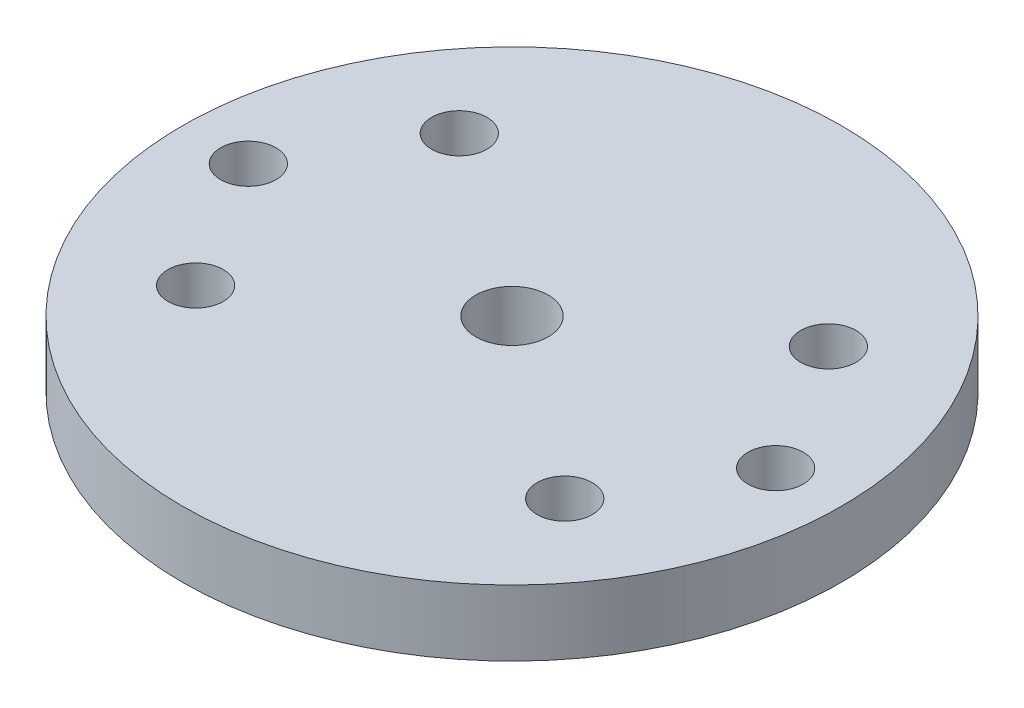
ISO-10303-21;
HEADER;
FILE_DESCRIPTION(('STEP AP214'),'2;1');
FILE_NAME('part.step','',(''),(''),'','','');
FILE_SCHEMA(('AUTOMOTIVE_DESIGN { 1 0 10303 214 1 1 1 1 }'));
ENDSEC;
DATA;
#1=APPLICATION_CONTEXT('core data for automotive mechanical design processes');
#2=APPLICATION_PROTOCOL_DEFINITION('international standard','automotive_design',2000,#1);
#3=PRODUCT_CONTEXT('',#1,'mechanical');
#4=PRODUCT('Part','Part','',(#3));
#5=PRODUCT_RELATED_PRODUCT_CATEGORY('part','',(#4));
#6=PRODUCT_DEFINITION_FORMATION('','',#4);
#7=PRODUCT_DEFINITION_CONTEXT('part definition',#1,'design');
#8=PRODUCT_DEFINITION('design','',#6,#7);
#9=PRODUCT_DEFINITION_SHAPE('','',#8);
#10=(LENGTH_UNIT() NAMED_UNIT(*) SI_UNIT(.MILLI.,.METRE.));
#11=(NAMED_UNIT(*) PLANE_ANGLE_UNIT() SI_UNIT($,.RADIAN.));
#12=(NAMED_UNIT(*) SI_UNIT($,.STERADIAN.) SOLID_ANGLE_UNIT());
#13=UNCERTAINTY_MEASURE_WITH_UNIT(LENGTH_MEASURE(1.E-05),#10,'distance_accuracy_value','');
#14=(GEOMETRIC_REPRESENTATION_CONTEXT(3) GLOBAL_UNCERTAINTY_ASSIGNED_CONTEXT((#13)) GLOBAL_UNIT_ASSIGNED_CONTEXT((#10,
#11,#12)) REPRESENTATION_CONTEXT('',''));
#15=CARTESIAN_POINT('',(0.,0.,0.));
#16=DIRECTION('',(0.,0.,1.));
#17=DIRECTION('',(1.,0.,0.));
#18=AXIS2_PLACEMENT_3D('',#15,#16,#17);
#19=CARTESIAN_POINT('',(0.,3.175,0.));
#20=DIRECTION('',(0.,1.,0.));
#21=DIRECTION('',(0.,0.,1.));
#22=AXIS2_PLACEMENT_3D('',#19,#20,#21);
#23=PLANE('',#22);
#24=CARTESIAN_POINT('',(17.78,3.175,12.7));
#25=DIRECTION('',(0.,-1.,0.));
#26=DIRECTION('',(0.,0.,-1.));
#27=AXIS2_PLACEMENT_3D('',#24,#25,#26);
#28=CIRCLE('',#27,2.667);
#29=CARTESIAN_POINT('',(17.78,3.175,10.033));
#30=VERTEX_POINT('',#29);
#31=EDGE_CURVE('E64',#30,#30,#28,.T.);
#32=ORIENTED_EDGE('',*,*,#31,.T.);
#33=EDGE_LOOP('',(#32));
#34=FACE_BOUND('',#33,.T.);
#35=CARTESIAN_POINT('',(25.4,3.175,0.));
#36=DIRECTION('',(0.,-1.,0.));
#37=DIRECTION('',(0.,0.,-1.));
#38=AXIS2_PLACEMENT_3D('',#35,#36,#37);
#39=CIRCLE('',#38,2.667);
#40=CARTESIAN_POINT('',(25.4,3.175,-2.667));
#41=VERTEX_POINT('',#40);
#42=EDGE_CURVE('E70',#41,#41,#39,.T.);
#43=ORIENTED_EDGE('',*,*,#42,.T.);
#44=EDGE_LOOP('',(#43));
#45=FACE_BOUND('',#44,.T.);
#46=CARTESIAN_POINT('',(17.78,3.175,-12.7));
#47=DIRECTION('',(0.,-1.,0.));
#48=DIRECTION('',(0.,0.,-1.));
#49=AXIS2_PLACEMENT_3D('',#46,#47,#48);
#50=CIRCLE('',#49,2.667);
#51=CARTESIAN_POINT('',(17.78,3.175,-15.367));
#52=VERTEX_POINT('',#51);
#53=EDGE_CURVE('E76',#52,#52,#50,.T.);
#54=ORIENTED_EDGE('',*,*,#53,.T.);
#55=EDGE_LOOP('',(#54));
#56=FACE_BOUND('',#55,.T.);
#57=CARTESIAN_POINT('',(-17.78,3.175,-12.7));
#58=DIRECTION('',(0.,-1.,0.));
#59=DIRECTION('',(0.,0.,-1.));
#60=AXIS2_PLACEMENT_3D('',#57,#58,#59);
#61=CIRCLE('',#60,2.667);
#62=CARTESIAN_POINT('',(-17.78,3.175,-15.367));
#63=VERTEX_POINT('',#62);
#64=EDGE_CURVE('E82',#63,#63,#61,.T.);
#65=ORIENTED_EDGE('',*,*,#64,.T.);
#66=EDGE_LOOP('',(#65));
#67=FACE_BOUND('',#66,.T.);
#68=CARTESIAN_POINT('',(-25.4,3.175,0.));
#69=DIRECTION('',(0.,-1.,0.));
#70=DIRECTION('',(0.,0.,-1.));
#71=AXIS2_PLACEMENT_3D('',#68,#69,#70);
#72=CIRCLE('',#71,2.667);
#73=CARTESIAN_POINT('',(-25.4,3.175,-2.667));
#74=VERTEX_POINT('',#73);
#75=EDGE_CURVE('E88',#74,#74,#72,.T.);
#76=ORIENTED_EDGE('',*,*,#75,.T.);
#77=EDGE_LOOP('',(#76));
#78=FACE_BOUND('',#77,.T.);
#79=CARTESIAN_POINT('',(-17.78,3.175,12.7));
#80=DIRECTION('',(0.,-1.,0.));
#81=DIRECTION('',(0.,0.,-1.));
#82=AXIS2_PLACEMENT_3D('',#79,#80,#81);
#83=CIRCLE('',#82,2.667);
#84=CARTESIAN_POINT('',(-17.78,3.175,10.033));
#85=VERTEX_POINT('',#84);
#86=EDGE_CURVE('E55',#85,#85,#83,.T.);
#87=ORIENTED_EDGE('',*,*,#86,.T.);
#88=EDGE_LOOP('',(#87));
#89=FACE_BOUND('',#88,.T.);
#90=CARTESIAN_POINT('',(0.,3.175,0.));
#91=DIRECTION('',(0.,1.,0.));
#92=DIRECTION('',(0.,0.,1.));
#93=AXIS2_PLACEMENT_3D('',#90,#91,#92);
#94=CIRCLE('',#93,31.75);
#95=CARTESIAN_POINT('',(0.,3.175,31.75));
#96=VERTEX_POINT('',#95);
#97=EDGE_CURVE('E10',#96,#96,#94,.T.);
#98=ORIENTED_EDGE('',*,*,#97,.T.);
#99=EDGE_LOOP('',(#98));
#100=FACE_BOUND('',#99,.T.);
#101=CARTESIAN_POINT('',(0.,3.175,0.));
#102=DIRECTION('',(0.,1.,0.));
#103=DIRECTION('',(0.,0.,1.));
#104=AXIS2_PLACEMENT_3D('',#101,#102,#103);
#105=CIRCLE('',#104,3.4925);
#106=CARTESIAN_POINT('',(0.,3.175,3.4925));
#107=VERTEX_POINT('',#106);
#108=EDGE_CURVE('E50',#107,#107,#105,.T.);
#109=ORIENTED_EDGE('',*,*,#108,.F.);
#110=EDGE_LOOP('',(#109));
#111=FACE_BOUND('',#110,.T.);
#112=ADVANCED_FACE('F39',(#34,#45,#56,#67,#78,#89,#100,#111),#23,.T.);
#113=CARTESIAN_POINT('',(0.,-3.175,0.));
#114=DIRECTION('',(0.,1.,0.));
#115=DIRECTION('',(0.,0.,1.));
#116=AXIS2_PLACEMENT_3D('',#113,#114,#115);
#117=PLANE('',#116);
#118=CARTESIAN_POINT('',(17.78,-3.175,12.7));
#119=DIRECTION('',(0.,-1.,0.));
#120=DIRECTION('',(0.,0.,-1.));
#121=AXIS2_PLACEMENT_3D('',#118,#119,#120);
#122=CIRCLE('',#121,2.667);
#123=CARTESIAN_POINT('',(17.78,-3.175,10.033));
#124=VERTEX_POINT('',#123);
#125=EDGE_CURVE('E67',#124,#124,#122,.T.);
#126=ORIENTED_EDGE('',*,*,#125,.F.);
#127=EDGE_LOOP('',(#126));
#128=FACE_BOUND('',#127,.T.);
#129=CARTESIAN_POINT('',(25.4,-3.175,0.));
#130=DIRECTION('',(0.,-1.,0.));
#131=DIRECTION('',(0.,0.,-1.));
#132=AXIS2_PLACEMENT_3D('',#129,#130,#131);
#133=CIRCLE('',#132,2.667);
#134=CARTESIAN_POINT('',(25.4,-3.175,-2.667));
#135=VERTEX_POINT('',#134);
#136=EDGE_CURVE('E73',#135,#135,#133,.T.);
#137=ORIENTED_EDGE('',*,*,#136,.F.);
#138=EDGE_LOOP('',(#137));
#139=FACE_BOUND('',#138,.T.);
#140=CARTESIAN_POINT('',(17.78,-3.175,-12.7));
#141=DIRECTION('',(0.,-1.,0.));
#142=DIRECTION('',(0.,0.,-1.));
#143=AXIS2_PLACEMENT_3D('',#140,#141,#142);
#144=CIRCLE('',#143,2.667);
#145=CARTESIAN_POINT('',(17.78,-3.175,-15.367));
#146=VERTEX_POINT('',#145);
#147=EDGE_CURVE('E79',#146,#146,#144,.T.);
#148=ORIENTED_EDGE('',*,*,#147,.F.);
#149=EDGE_LOOP('',(#148));
#150=FACE_BOUND('',#149,.T.);
#151=CARTESIAN_POINT('',(-17.78,-3.175,-12.7));
#152=DIRECTION('',(0.,-1.,0.));
#153=DIRECTION('',(0.,0.,-1.));
#154=AXIS2_PLACEMENT_3D('',#151,#152,#153);
#155=CIRCLE('',#154,2.667);
#156=CARTESIAN_POINT('',(-17.78,-3.175,-15.367));
#157=VERTEX_POINT('',#156);
#158=EDGE_CURVE('E85',#157,#157,#155,.T.);
#159=ORIENTED_EDGE('',*,*,#158,.F.);
#160=EDGE_LOOP('',(#159));
#161=FACE_BOUND('',#160,.T.);
#162=CARTESIAN_POINT('',(-25.4,-3.175,0.));
#163=DIRECTION('',(0.,-1.,0.));
#164=DIRECTION('',(0.,0.,-1.));
#165=AXIS2_PLACEMENT_3D('',#162,#163,#164);
#166=CIRCLE('',#165,2.667);
#167=CARTESIAN_POINT('',(-25.4,-3.175,-2.667));
#168=VERTEX_POINT('',#167);
#169=EDGE_CURVE('E61',#168,#168,#166,.T.);
#170=ORIENTED_EDGE('',*,*,#169,.F.);
#171=EDGE_LOOP('',(#170));
#172=FACE_BOUND('',#171,.T.);
#173=CARTESIAN_POINT('',(-17.78,-3.175,12.7));
#174=DIRECTION('',(0.,-1.,0.));
#175=DIRECTION('',(0.,0.,-1.));
#176=AXIS2_PLACEMENT_3D('',#173,#174,#175);
#177=CIRCLE('',#176,2.667);
#178=CARTESIAN_POINT('',(-17.78,-3.175,10.033));
#179=VERTEX_POINT('',#178);
#180=EDGE_CURVE('E58',#179,#179,#177,.T.);
#181=ORIENTED_EDGE('',*,*,#180,.F.);
#182=EDGE_LOOP('',(#181));
#183=FACE_BOUND('',#182,.T.);
#184=CARTESIAN_POINT('',(0.,-3.175,0.));
#185=DIRECTION('',(0.,1.,0.));
#186=DIRECTION('',(0.,0.,1.));
#187=AXIS2_PLACEMENT_3D('',#184,#185,#186);
#188=CIRCLE('',#187,31.75);
#189=CARTESIAN_POINT('',(0.,-3.175,31.75));
#190=VERTEX_POINT('',#189);
#191=EDGE_CURVE('E43',#190,#190,#188,.T.);
#192=ORIENTED_EDGE('',*,*,#191,.F.);
#193=EDGE_LOOP('',(#192));
#194=FACE_BOUND('',#193,.T.);
#195=CARTESIAN_POINT('',(0.,-3.175,0.));
#196=DIRECTION('',(0.,1.,0.));
#197=DIRECTION('',(0.,0.,1.));
#198=AXIS2_PLACEMENT_3D('',#195,#196,#197);
#199=CIRCLE('',#198,3.4925);
#200=CARTESIAN_POINT('',(0.,-3.175,3.4925));
#201=VERTEX_POINT('',#200);
#202=EDGE_CURVE('E52',#201,#201,#199,.T.);
#203=ORIENTED_EDGE('',*,*,#202,.T.);
#204=EDGE_LOOP('',(#203));
#205=FACE_BOUND('',#204,.T.);
#206=ADVANCED_FACE('F96',(#128,#139,#150,#161,#172,#183,#194,#205),#117,.F.);
#207=CARTESIAN_POINT('',(0.,3.175,0.));
#208=DIRECTION('',(0.,-1.,0.));
#209=DIRECTION('',(0.,0.,-1.));
#210=AXIS2_PLACEMENT_3D('',#207,#208,#209);
#211=CYLINDRICAL_SURFACE('',#210,31.75);
#212=ORIENTED_EDGE('',*,*,#97,.F.);
#213=EDGE_LOOP('',(#212));
#214=FACE_BOUND('',#213,.T.);
#215=ORIENTED_EDGE('',*,*,#191,.T.);
#216=EDGE_LOOP('',(#215));
#217=FACE_BOUND('',#216,.T.);
#218=ADVANCED_FACE('F41',(#214,#217),#211,.T.);
#219=CARTESIAN_POINT('',(0.,3.175,0.));
#220=DIRECTION('',(0.,-1.,0.));
#221=DIRECTION('',(0.,0.,-1.));
#222=AXIS2_PLACEMENT_3D('',#219,#220,#221);
#223=CYLINDRICAL_SURFACE('',#222,3.4925);
#224=ORIENTED_EDGE('',*,*,#108,.T.);
#225=EDGE_LOOP('',(#224));
#226=FACE_BOUND('',#225,.T.);
#227=ORIENTED_EDGE('',*,*,#202,.F.);
#228=EDGE_LOOP('',(#227));
#229=FACE_BOUND('',#228,.T.);
#230=ADVANCED_FACE('F106',(#226,#229),#223,.F.);
#231=CARTESIAN_POINT('',(-17.78,3.175,12.7));
#232=DIRECTION('',(0.,-1.,0.));
#233=DIRECTION('',(0.,0.,-1.));
#234=AXIS2_PLACEMENT_3D('',#231,#232,#233);
#235=CYLINDRICAL_SURFACE('',#234,2.667);
#236=ORIENTED_EDGE('',*,*,#86,.F.);
#237=EDGE_LOOP('',(#236));
#238=FACE_BOUND('',#237,.T.);
#239=ORIENTED_EDGE('',*,*,#180,.T.);
#240=EDGE_LOOP('',(#239));
#241=FACE_BOUND('',#240,.T.);
#242=ADVANCED_FACE('F108',(#238,#241),#235,.F.);
#243=CARTESIAN_POINT('',(-25.4,3.175,0.));
#244=DIRECTION('',(0.,-1.,0.));
#245=DIRECTION('',(0.,0.,-1.));
#246=AXIS2_PLACEMENT_3D('',#243,#244,#245);
#247=CYLINDRICAL_SURFACE('',#246,2.667);
#248=ORIENTED_EDGE('',*,*,#75,.F.);
#249=EDGE_LOOP('',(#248));
#250=FACE_BOUND('',#249,.T.);
#251=ORIENTED_EDGE('',*,*,#169,.T.);
#252=EDGE_LOOP('',(#251));
#253=FACE_BOUND('',#252,.T.);
#254=ADVANCED_FACE('F94',(#250,#253),#247,.F.);
#255=CARTESIAN_POINT('',(-17.78,3.175,-12.7));
#256=DIRECTION('',(0.,-1.,0.));
#257=DIRECTION('',(0.,0.,-1.));
#258=AXIS2_PLACEMENT_3D('',#255,#256,#257);
#259=CYLINDRICAL_SURFACE('',#258,2.667);
#260=ORIENTED_EDGE('',*,*,#64,.F.);
#261=EDGE_LOOP('',(#260));
#262=FACE_BOUND('',#261,.T.);
#263=ORIENTED_EDGE('',*,*,#158,.T.);
#264=EDGE_LOOP('',(#263));
#265=FACE_BOUND('',#264,.T.);
#266=ADVANCED_FACE('F139',(#262,#265),#259,.F.);
#267=CARTESIAN_POINT('',(17.78,3.175,-12.7));
#268=DIRECTION('',(0.,-1.,0.));
#269=DIRECTION('',(0.,0.,-1.));
#270=AXIS2_PLACEMENT_3D('',#267,#268,#269);
#271=CYLINDRICAL_SURFACE('',#270,2.667);
#272=ORIENTED_EDGE('',*,*,#53,.F.);
#273=EDGE_LOOP('',(#272));
#274=FACE_BOUND('',#273,.T.);
#275=ORIENTED_EDGE('',*,*,#147,.T.);
#276=EDGE_LOOP('',(#275));
#277=FACE_BOUND('',#276,.T.);
#278=ADVANCED_FACE('F144',(#274,#277),#271,.F.);
#279=CARTESIAN_POINT('',(25.4,3.175,0.));
#280=DIRECTION('',(0.,-1.,0.));
#281=DIRECTION('',(0.,0.,-1.));
#282=AXIS2_PLACEMENT_3D('',#279,#280,#281);
#283=CYLINDRICAL_SURFACE('',#282,2.667);
#284=ORIENTED_EDGE('',*,*,#42,.F.);
#285=EDGE_LOOP('',(#284));
#286=FACE_BOUND('',#285,.T.);
#287=ORIENTED_EDGE('',*,*,#136,.T.);
#288=EDGE_LOOP('',(#287));
#289=FACE_BOUND('',#288,.T.);
#290=ADVANCED_FACE('F150',(#286,#289),#283,.F.);
#291=CARTESIAN_POINT('',(17.78,3.175,12.7));
#292=DIRECTION('',(0.,-1.,0.));
#293=DIRECTION('',(0.,0.,-1.));
#294=AXIS2_PLACEMENT_3D('',#291,#292,#293);
#295=CYLINDRICAL_SURFACE('',#294,2.667);
#296=ORIENTED_EDGE('',*,*,#31,.F.);
#297=EDGE_LOOP('',(#296));
#298=FACE_BOUND('',#297,.T.);
#299=ORIENTED_EDGE('',*,*,#125,.T.);
#300=EDGE_LOOP('',(#299));
#301=FACE_BOUND('',#300,.T.);
#302=ADVANCED_FACE('F154',(#298,#301),#295,.F.);
#303=CLOSED_SHELL('',(#112,#206,#218,#230,#242,#254,#266,#278,#290,#302));
#304=MANIFOLD_SOLID_BREP('B2',#303);
#305=ADVANCED_BREP_SHAPE_REPRESENTATION('',(#18,#304),#14);
#306=SHAPE_DEFINITION_REPRESENTATION(#9,#305);
ENDSEC;
END-ISO-10303-21;
